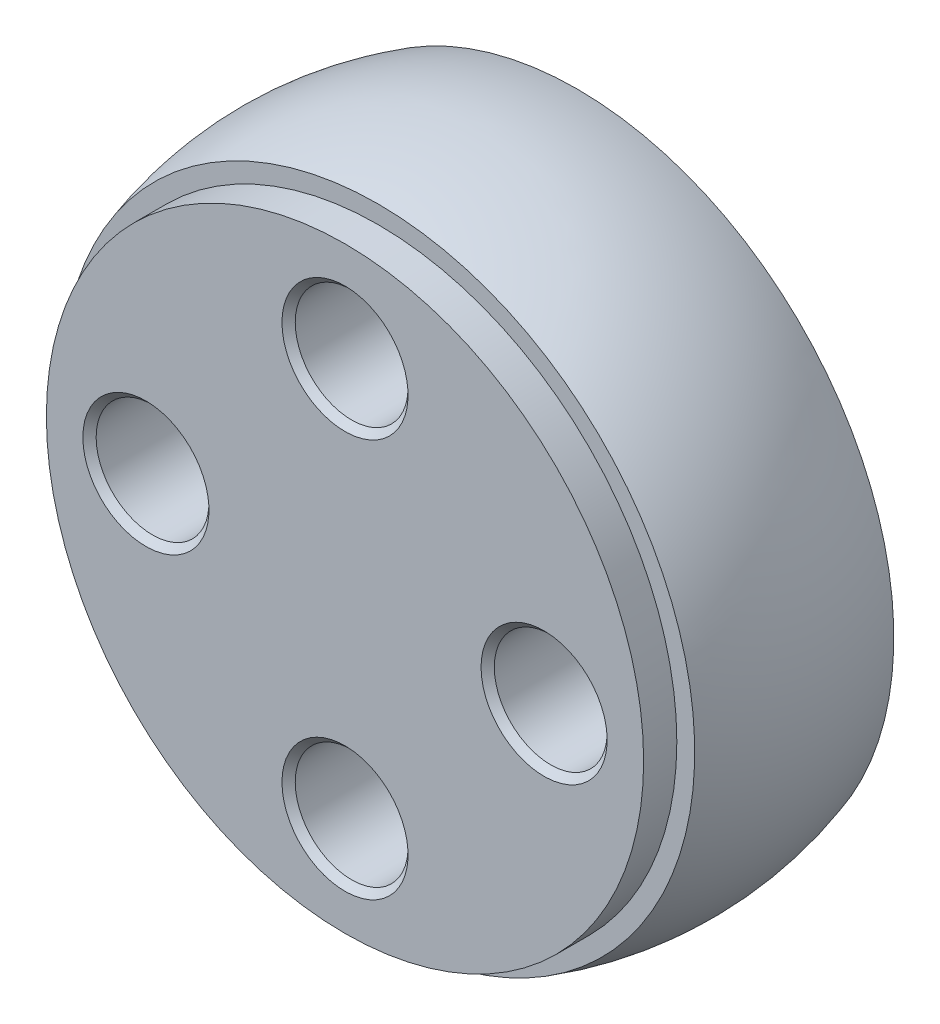
ISO-10303-21;
HEADER;
FILE_DESCRIPTION(('STEP AP214'),'2;1');
FILE_NAME('part.step','',(''),(''),'','','');
FILE_SCHEMA(('AUTOMOTIVE_DESIGN { 1 0 10303 214 1 1 1 1 }'));
ENDSEC;
DATA;
#1=APPLICATION_CONTEXT('core data for automotive mechanical design processes');
#2=APPLICATION_PROTOCOL_DEFINITION('international standard','automotive_design',2000,#1);
#3=PRODUCT_CONTEXT('',#1,'mechanical');
#4=PRODUCT('Part','Part','',(#3));
#5=PRODUCT_RELATED_PRODUCT_CATEGORY('part','',(#4));
#6=PRODUCT_DEFINITION_FORMATION('','',#4);
#7=PRODUCT_DEFINITION_CONTEXT('part definition',#1,'design');
#8=PRODUCT_DEFINITION('design','',#6,#7);
#9=PRODUCT_DEFINITION_SHAPE('','',#8);
#10=(LENGTH_UNIT() NAMED_UNIT(*) SI_UNIT(.MILLI.,.METRE.));
#11=(NAMED_UNIT(*) PLANE_ANGLE_UNIT() SI_UNIT($,.RADIAN.));
#12=(NAMED_UNIT(*) SI_UNIT($,.STERADIAN.) SOLID_ANGLE_UNIT());
#13=UNCERTAINTY_MEASURE_WITH_UNIT(LENGTH_MEASURE(1.E-05),#10,'distance_accuracy_value','');
#14=(GEOMETRIC_REPRESENTATION_CONTEXT(3) GLOBAL_UNCERTAINTY_ASSIGNED_CONTEXT((#13)) GLOBAL_UNIT_ASSIGNED_CONTEXT((#10,
#11,#12)) REPRESENTATION_CONTEXT('',''));
#15=CARTESIAN_POINT('',(0.,0.,0.));
#16=DIRECTION('',(0.,0.,1.));
#17=DIRECTION('',(1.,0.,0.));
#18=AXIS2_PLACEMENT_3D('',#15,#16,#17);
#19=CARTESIAN_POINT('',(0.,0.,0.));
#20=DIRECTION('',(0.,0.,-1.));
#21=DIRECTION('',(0.,1.,0.));
#22=AXIS2_PLACEMENT_3D('',#19,#20,#21);
#23=SPHERICAL_SURFACE('',#22,10.);
#24=CARTESIAN_POINT('',(0.,0.,3.));
#25=DIRECTION('',(0.,0.,-1.));
#26=DIRECTION('',(0.,1.,0.));
#27=AXIS2_PLACEMENT_3D('',#24,#25,#26);
#28=CIRCLE('',#27,9.53939201416946);
#29=CARTESIAN_POINT('',(0.,9.53939201416946,3.));
#30=VERTEX_POINT('',#29);
#31=EDGE_CURVE('E45',#30,#30,#28,.T.);
#32=ORIENTED_EDGE('',*,*,#31,.T.);
#33=EDGE_LOOP('',(#32));
#34=FACE_BOUND('',#33,.T.);
#35=CARTESIAN_POINT('',(0.,0.,-3.));
#36=DIRECTION('',(0.,0.,-1.));
#37=DIRECTION('',(0.,1.,0.));
#38=AXIS2_PLACEMENT_3D('',#35,#36,#37);
#39=CIRCLE('',#38,9.53939201416945);
#40=CARTESIAN_POINT('',(0.,9.53939201416945,-3.));
#41=VERTEX_POINT('',#40);
#42=EDGE_CURVE('E10',#41,#41,#39,.T.);
#43=ORIENTED_EDGE('',*,*,#42,.F.);
#44=EDGE_LOOP('',(#43));
#45=FACE_BOUND('',#44,.T.);
#46=ADVANCED_FACE('F31',(#34,#45),#23,.T.);
#47=CARTESIAN_POINT('',(0.,0.,-3.));
#48=DIRECTION('',(0.,0.,-1.));
#49=DIRECTION('',(0.,1.,0.));
#50=AXIS2_PLACEMENT_3D('',#47,#48,#49);
#51=PLANE('',#50);
#52=CARTESIAN_POINT('',(6.,0.,-3.));
#53=DIRECTION('',(0.,0.,-1.));
#54=DIRECTION('',(-1.,0.,0.));
#55=AXIS2_PLACEMENT_3D('',#52,#53,#54);
#56=CIRCLE('',#55,3.25);
#57=CARTESIAN_POINT('',(2.75,0.,-3.));
#58=VERTEX_POINT('',#57);
#59=EDGE_CURVE('E128',#58,#58,#56,.T.);
#60=ORIENTED_EDGE('',*,*,#59,.F.);
#61=EDGE_LOOP('',(#60));
#62=FACE_BOUND('',#61,.T.);
#63=CARTESIAN_POINT('',(-6.,0.,-3.));
#64=DIRECTION('',(0.,0.,-1.));
#65=DIRECTION('',(-1.,0.,0.));
#66=AXIS2_PLACEMENT_3D('',#63,#64,#65);
#67=CIRCLE('',#66,3.25);
#68=CARTESIAN_POINT('',(-9.25,0.,-3.));
#69=VERTEX_POINT('',#68);
#70=EDGE_CURVE('E107',#69,#69,#67,.T.);
#71=ORIENTED_EDGE('',*,*,#70,.F.);
#72=EDGE_LOOP('',(#71));
#73=FACE_BOUND('',#72,.T.);
#74=CARTESIAN_POINT('',(0.,6.,-3.));
#75=DIRECTION('',(0.,0.,-1.));
#76=DIRECTION('',(-1.,0.,0.));
#77=AXIS2_PLACEMENT_3D('',#74,#75,#76);
#78=CIRCLE('',#77,3.25);
#79=CARTESIAN_POINT('',(-3.25,6.,-3.));
#80=VERTEX_POINT('',#79);
#81=EDGE_CURVE('E86',#80,#80,#78,.T.);
#82=ORIENTED_EDGE('',*,*,#81,.F.);
#83=EDGE_LOOP('',(#82));
#84=FACE_BOUND('',#83,.T.);
#85=CARTESIAN_POINT('',(0.,-6.,-3.));
#86=DIRECTION('',(0.,0.,-1.));
#87=DIRECTION('',(-1.,0.,0.));
#88=AXIS2_PLACEMENT_3D('',#85,#86,#87);
#89=CIRCLE('',#88,3.25);
#90=CARTESIAN_POINT('',(-3.25,-6.,-3.));
#91=VERTEX_POINT('',#90);
#92=EDGE_CURVE('E65',#91,#91,#89,.T.);
#93=ORIENTED_EDGE('',*,*,#92,.F.);
#94=EDGE_LOOP('',(#93));
#95=FACE_BOUND('',#94,.T.);
#96=ORIENTED_EDGE('',*,*,#42,.T.);
#97=EDGE_LOOP('',(#96));
#98=FACE_BOUND('',#97,.T.);
#99=ADVANCED_FACE('F175',(#62,#73,#84,#95,#98),#51,.T.);
#100=CARTESIAN_POINT('',(0.,9.,4.));
#101=DIRECTION('',(0.,0.,1.));
#102=DIRECTION('',(0.,-1.,0.));
#103=AXIS2_PLACEMENT_3D('',#100,#101,#102);
#104=PLANE('',#103);
#105=CARTESIAN_POINT('',(6.,0.,4.));
#106=DIRECTION('',(0.,0.,-1.));
#107=DIRECTION('',(-1.,0.,0.));
#108=AXIS2_PLACEMENT_3D('',#105,#106,#107);
#109=CIRCLE('',#108,1.9);
#110=CARTESIAN_POINT('',(4.1,0.,4.));
#111=VERTEX_POINT('',#110);
#112=EDGE_CURVE('E131',#111,#111,#109,.T.);
#113=ORIENTED_EDGE('',*,*,#112,.T.);
#114=EDGE_LOOP('',(#113));
#115=FACE_BOUND('',#114,.T.);
#116=CARTESIAN_POINT('',(-6.,0.,4.));
#117=DIRECTION('',(0.,0.,-1.));
#118=DIRECTION('',(-1.,0.,0.));
#119=AXIS2_PLACEMENT_3D('',#116,#117,#118);
#120=CIRCLE('',#119,1.9);
#121=CARTESIAN_POINT('',(-7.9,0.,4.));
#122=VERTEX_POINT('',#121);
#123=EDGE_CURVE('E110',#122,#122,#120,.T.);
#124=ORIENTED_EDGE('',*,*,#123,.T.);
#125=EDGE_LOOP('',(#124));
#126=FACE_BOUND('',#125,.T.);
#127=CARTESIAN_POINT('',(0.,6.,4.));
#128=DIRECTION('',(0.,0.,-1.));
#129=DIRECTION('',(-1.,0.,0.));
#130=AXIS2_PLACEMENT_3D('',#127,#128,#129);
#131=CIRCLE('',#130,1.9);
#132=CARTESIAN_POINT('',(-1.9,6.,4.));
#133=VERTEX_POINT('',#132);
#134=EDGE_CURVE('E89',#133,#133,#131,.T.);
#135=ORIENTED_EDGE('',*,*,#134,.T.);
#136=EDGE_LOOP('',(#135));
#137=FACE_BOUND('',#136,.T.);
#138=CARTESIAN_POINT('',(0.,-6.,4.));
#139=DIRECTION('',(0.,0.,-1.));
#140=DIRECTION('',(-1.,0.,0.));
#141=AXIS2_PLACEMENT_3D('',#138,#139,#140);
#142=CIRCLE('',#141,1.9);
#143=CARTESIAN_POINT('',(-1.9,-6.,4.));
#144=VERTEX_POINT('',#143);
#145=EDGE_CURVE('E68',#144,#144,#142,.T.);
#146=ORIENTED_EDGE('',*,*,#145,.T.);
#147=EDGE_LOOP('',(#146));
#148=FACE_BOUND('',#147,.T.);
#149=CARTESIAN_POINT('',(0.,0.,4.));
#150=DIRECTION('',(0.,0.,-1.));
#151=DIRECTION('',(0.,1.,0.));
#152=AXIS2_PLACEMENT_3D('',#149,#150,#151);
#153=CIRCLE('',#152,9.);
#154=CARTESIAN_POINT('',(0.,9.,4.));
#155=VERTEX_POINT('',#154);
#156=EDGE_CURVE('E37',#155,#155,#153,.T.);
#157=ORIENTED_EDGE('',*,*,#156,.F.);
#158=EDGE_LOOP('',(#157));
#159=FACE_BOUND('',#158,.T.);
#160=ADVANCED_FACE('F135',(#115,#126,#137,#148,#159),#104,.T.);
#161=CARTESIAN_POINT('',(0.,0.,0.));
#162=DIRECTION('',(0.,0.,-1.));
#163=DIRECTION('',(0.,1.,0.));
#164=AXIS2_PLACEMENT_3D('',#161,#162,#163);
#165=CYLINDRICAL_SURFACE('',#164,9.);
#166=ORIENTED_EDGE('',*,*,#156,.T.);
#167=EDGE_LOOP('',(#166));
#168=FACE_BOUND('',#167,.T.);
#169=CARTESIAN_POINT('',(0.,0.,3.));
#170=DIRECTION('',(0.,0.,-1.));
#171=DIRECTION('',(0.,1.,0.));
#172=AXIS2_PLACEMENT_3D('',#169,#170,#171);
#173=CIRCLE('',#172,9.);
#174=CARTESIAN_POINT('',(0.,9.,3.));
#175=VERTEX_POINT('',#174);
#176=EDGE_CURVE('E41',#175,#175,#173,.T.);
#177=ORIENTED_EDGE('',*,*,#176,.F.);
#178=EDGE_LOOP('',(#177));
#179=FACE_BOUND('',#178,.T.);
#180=ADVANCED_FACE('F211',(#168,#179),#165,.T.);
#181=CARTESIAN_POINT('',(0.,9.,3.));
#182=DIRECTION('',(0.,0.,1.));
#183=DIRECTION('',(0.,-1.,0.));
#184=AXIS2_PLACEMENT_3D('',#181,#182,#183);
#185=PLANE('',#184);
#186=ORIENTED_EDGE('',*,*,#176,.T.);
#187=EDGE_LOOP('',(#186));
#188=FACE_BOUND('',#187,.T.);
#189=ORIENTED_EDGE('',*,*,#31,.F.);
#190=EDGE_LOOP('',(#189));
#191=FACE_BOUND('',#190,.T.);
#192=ADVANCED_FACE('F208',(#188,#191),#185,.T.);
#193=CARTESIAN_POINT('',(0.,-6.,3.8));
#194=DIRECTION('',(0.,0.,1.));
#195=DIRECTION('',(1.,0.,0.));
#196=AXIS2_PLACEMENT_3D('',#193,#194,#195);
#197=CONICAL_SURFACE('',#196,1.7,0.78539816339745);
#198=ORIENTED_EDGE('',*,*,#145,.F.);
#199=EDGE_LOOP('',(#198));
#200=FACE_BOUND('',#199,.T.);
#201=CARTESIAN_POINT('',(0.,-6.,3.8));
#202=DIRECTION('',(0.,0.,-1.));
#203=DIRECTION('',(-1.,0.,0.));
#204=AXIS2_PLACEMENT_3D('',#201,#202,#203);
#205=CIRCLE('',#204,1.7);
#206=CARTESIAN_POINT('',(-1.7,-6.,3.8));
#207=VERTEX_POINT('',#206);
#208=EDGE_CURVE('E50',#207,#207,#205,.T.);
#209=ORIENTED_EDGE('',*,*,#208,.T.);
#210=EDGE_LOOP('',(#209));
#211=FACE_BOUND('',#210,.T.);
#212=ADVANCED_FACE('F210',(#200,#211),#197,.F.);
#213=CARTESIAN_POINT('',(0.,-6.,-3.));
#214=DIRECTION('',(0.,0.,-1.));
#215=DIRECTION('',(-1.,0.,0.));
#216=AXIS2_PLACEMENT_3D('',#213,#214,#215);
#217=CYLINDRICAL_SURFACE('',#216,1.7);
#218=ORIENTED_EDGE('',*,*,#208,.F.);
#219=EDGE_LOOP('',(#218));
#220=FACE_BOUND('',#219,.T.);
#221=CARTESIAN_POINT('',(0.,-6.,0.599999999999995));
#222=DIRECTION('',(0.,0.,-1.));
#223=DIRECTION('',(-1.,0.,0.));
#224=AXIS2_PLACEMENT_3D('',#221,#222,#223);
#225=CIRCLE('',#224,1.7);
#226=CARTESIAN_POINT('',(-1.7,-6.,0.599999999999995));
#227=VERTEX_POINT('',#226);
#228=EDGE_CURVE('E53',#227,#227,#225,.T.);
#229=ORIENTED_EDGE('',*,*,#228,.T.);
#230=EDGE_LOOP('',(#229));
#231=FACE_BOUND('',#230,.T.);
#232=ADVANCED_FACE('F218',(#220,#231),#217,.F.);
#233=CARTESIAN_POINT('',(0.,-6.,0.399999999999996));
#234=DIRECTION('',(0.,0.,-1.));
#235=DIRECTION('',(-1.,0.,0.));
#236=AXIS2_PLACEMENT_3D('',#233,#234,#235);
#237=CONICAL_SURFACE('',#236,1.9,0.785398163397452);
#238=ORIENTED_EDGE('',*,*,#228,.F.);
#239=EDGE_LOOP('',(#238));
#240=FACE_BOUND('',#239,.T.);
#241=CARTESIAN_POINT('',(0.,-6.,0.399999999999996));
#242=DIRECTION('',(0.,0.,-1.));
#243=DIRECTION('',(-1.,0.,0.));
#244=AXIS2_PLACEMENT_3D('',#241,#242,#243);
#245=CIRCLE('',#244,1.9);
#246=CARTESIAN_POINT('',(-1.9,-6.,0.399999999999996));
#247=VERTEX_POINT('',#246);
#248=EDGE_CURVE('E56',#247,#247,#245,.T.);
#249=ORIENTED_EDGE('',*,*,#248,.T.);
#250=EDGE_LOOP('',(#249));
#251=FACE_BOUND('',#250,.T.);
#252=ADVANCED_FACE('F262',(#240,#251),#237,.F.);
#253=CARTESIAN_POINT('',(1.9,-6.,0.399999999999996));
#254=DIRECTION('',(0.,0.,1.));
#255=DIRECTION('',(1.,0.,0.));
#256=AXIS2_PLACEMENT_3D('',#253,#254,#255);
#257=PLANE('',#256);
#258=ORIENTED_EDGE('',*,*,#248,.F.);
#259=EDGE_LOOP('',(#258));
#260=FACE_BOUND('',#259,.T.);
#261=CARTESIAN_POINT('',(0.,-6.,0.399999999999996));
#262=DIRECTION('',(0.,0.,-1.));
#263=DIRECTION('',(-1.,0.,0.));
#264=AXIS2_PLACEMENT_3D('',#261,#262,#263);
#265=CIRCLE('',#264,3.);
#266=CARTESIAN_POINT('',(-3.,-6.,0.399999999999996));
#267=VERTEX_POINT('',#266);
#268=EDGE_CURVE('E59',#267,#267,#265,.T.);
#269=ORIENTED_EDGE('',*,*,#268,.T.);
#270=EDGE_LOOP('',(#269));
#271=FACE_BOUND('',#270,.T.);
#272=ADVANCED_FACE('F197',(#260,#271),#257,.F.);
#273=CARTESIAN_POINT('',(0.,-6.,-3.));
#274=DIRECTION('',(0.,0.,-1.));
#275=DIRECTION('',(-1.,0.,0.));
#276=AXIS2_PLACEMENT_3D('',#273,#274,#275);
#277=CYLINDRICAL_SURFACE('',#276,3.);
#278=ORIENTED_EDGE('',*,*,#268,.F.);
#279=EDGE_LOOP('',(#278));
#280=FACE_BOUND('',#279,.T.);
#281=CARTESIAN_POINT('',(0.,-6.,-2.75));
#282=DIRECTION('',(0.,0.,-1.));
#283=DIRECTION('',(-1.,0.,0.));
#284=AXIS2_PLACEMENT_3D('',#281,#282,#283);
#285=CIRCLE('',#284,3.);
#286=CARTESIAN_POINT('',(-3.,-6.,-2.75));
#287=VERTEX_POINT('',#286);
#288=EDGE_CURVE('E62',#287,#287,#285,.T.);
#289=ORIENTED_EDGE('',*,*,#288,.T.);
#290=EDGE_LOOP('',(#289));
#291=FACE_BOUND('',#290,.T.);
#292=ADVANCED_FACE('F187',(#280,#291),#277,.F.);
#293=CARTESIAN_POINT('',(0.,-6.,-3.));
#294=DIRECTION('',(0.,0.,-1.));
#295=DIRECTION('',(-1.,0.,0.));
#296=AXIS2_PLACEMENT_3D('',#293,#294,#295);
#297=CONICAL_SURFACE('',#296,3.25,0.785398163397448);
#298=ORIENTED_EDGE('',*,*,#288,.F.);
#299=EDGE_LOOP('',(#298));
#300=FACE_BOUND('',#299,.T.);
#301=ORIENTED_EDGE('',*,*,#92,.T.);
#302=EDGE_LOOP('',(#301));
#303=FACE_BOUND('',#302,.T.);
#304=ADVANCED_FACE('F184',(#300,#303),#297,.F.);
#305=CARTESIAN_POINT('',(0.,6.,3.8));
#306=DIRECTION('',(0.,0.,1.));
#307=DIRECTION('',(1.,0.,0.));
#308=AXIS2_PLACEMENT_3D('',#305,#306,#307);
#309=CONICAL_SURFACE('',#308,1.7,0.78539816339745);
#310=ORIENTED_EDGE('',*,*,#134,.F.);
#311=EDGE_LOOP('',(#310));
#312=FACE_BOUND('',#311,.T.);
#313=CARTESIAN_POINT('',(0.,6.,3.8));
#314=DIRECTION('',(0.,0.,-1.));
#315=DIRECTION('',(-1.,0.,0.));
#316=AXIS2_PLACEMENT_3D('',#313,#314,#315);
#317=CIRCLE('',#316,1.7);
#318=CARTESIAN_POINT('',(-1.7,6.,3.8));
#319=VERTEX_POINT('',#318);
#320=EDGE_CURVE('E71',#319,#319,#317,.T.);
#321=ORIENTED_EDGE('',*,*,#320,.T.);
#322=EDGE_LOOP('',(#321));
#323=FACE_BOUND('',#322,.T.);
#324=ADVANCED_FACE('F186',(#312,#323),#309,.F.);
#325=CARTESIAN_POINT('',(0.,6.,-3.));
#326=DIRECTION('',(0.,0.,-1.));
#327=DIRECTION('',(-1.,0.,0.));
#328=AXIS2_PLACEMENT_3D('',#325,#326,#327);
#329=CYLINDRICAL_SURFACE('',#328,1.7);
#330=ORIENTED_EDGE('',*,*,#320,.F.);
#331=EDGE_LOOP('',(#330));
#332=FACE_BOUND('',#331,.T.);
#333=CARTESIAN_POINT('',(0.,6.,0.599999999999995));
#334=DIRECTION('',(0.,0.,-1.));
#335=DIRECTION('',(-1.,0.,0.));
#336=AXIS2_PLACEMENT_3D('',#333,#334,#335);
#337=CIRCLE('',#336,1.7);
#338=CARTESIAN_POINT('',(-1.7,6.,0.599999999999995));
#339=VERTEX_POINT('',#338);
#340=EDGE_CURVE('E74',#339,#339,#337,.T.);
#341=ORIENTED_EDGE('',*,*,#340,.T.);
#342=EDGE_LOOP('',(#341));
#343=FACE_BOUND('',#342,.T.);
#344=ADVANCED_FACE('F194',(#332,#343),#329,.F.);
#345=CARTESIAN_POINT('',(0.,6.,0.399999999999996));
#346=DIRECTION('',(0.,0.,-1.));
#347=DIRECTION('',(-1.,0.,0.));
#348=AXIS2_PLACEMENT_3D('',#345,#346,#347);
#349=CONICAL_SURFACE('',#348,1.9,0.785398163397452);
#350=ORIENTED_EDGE('',*,*,#340,.F.);
#351=EDGE_LOOP('',(#350));
#352=FACE_BOUND('',#351,.T.);
#353=CARTESIAN_POINT('',(0.,6.,0.399999999999996));
#354=DIRECTION('',(0.,0.,-1.));
#355=DIRECTION('',(-1.,0.,0.));
#356=AXIS2_PLACEMENT_3D('',#353,#354,#355);
#357=CIRCLE('',#356,1.9);
#358=CARTESIAN_POINT('',(-1.9,6.,0.399999999999996));
#359=VERTEX_POINT('',#358);
#360=EDGE_CURVE('E77',#359,#359,#357,.T.);
#361=ORIENTED_EDGE('',*,*,#360,.T.);
#362=EDGE_LOOP('',(#361));
#363=FACE_BOUND('',#362,.T.);
#364=ADVANCED_FACE('F300',(#352,#363),#349,.F.);
#365=CARTESIAN_POINT('',(1.9,6.,0.399999999999996));
#366=DIRECTION('',(0.,0.,1.));
#367=DIRECTION('',(1.,0.,0.));
#368=AXIS2_PLACEMENT_3D('',#365,#366,#367);
#369=PLANE('',#368);
#370=ORIENTED_EDGE('',*,*,#360,.F.);
#371=EDGE_LOOP('',(#370));
#372=FACE_BOUND('',#371,.T.);
#373=CARTESIAN_POINT('',(0.,6.,0.399999999999996));
#374=DIRECTION('',(0.,0.,-1.));
#375=DIRECTION('',(-1.,0.,0.));
#376=AXIS2_PLACEMENT_3D('',#373,#374,#375);
#377=CIRCLE('',#376,3.);
#378=CARTESIAN_POINT('',(-3.,6.,0.399999999999996));
#379=VERTEX_POINT('',#378);
#380=EDGE_CURVE('E80',#379,#379,#377,.T.);
#381=ORIENTED_EDGE('',*,*,#380,.T.);
#382=EDGE_LOOP('',(#381));
#383=FACE_BOUND('',#382,.T.);
#384=ADVANCED_FACE('F309',(#372,#383),#369,.F.);
#385=CARTESIAN_POINT('',(0.,6.,-3.));
#386=DIRECTION('',(0.,0.,-1.));
#387=DIRECTION('',(-1.,0.,0.));
#388=AXIS2_PLACEMENT_3D('',#385,#386,#387);
#389=CYLINDRICAL_SURFACE('',#388,3.);
#390=ORIENTED_EDGE('',*,*,#380,.F.);
#391=EDGE_LOOP('',(#390));
#392=FACE_BOUND('',#391,.T.);
#393=CARTESIAN_POINT('',(0.,6.,-2.75));
#394=DIRECTION('',(0.,0.,-1.));
#395=DIRECTION('',(-1.,0.,0.));
#396=AXIS2_PLACEMENT_3D('',#393,#394,#395);
#397=CIRCLE('',#396,3.);
#398=CARTESIAN_POINT('',(-3.,6.,-2.75));
#399=VERTEX_POINT('',#398);
#400=EDGE_CURVE('E83',#399,#399,#397,.T.);
#401=ORIENTED_EDGE('',*,*,#400,.T.);
#402=EDGE_LOOP('',(#401));
#403=FACE_BOUND('',#402,.T.);
#404=ADVANCED_FACE('F318',(#392,#403),#389,.F.);
#405=CARTESIAN_POINT('',(0.,6.,-3.));
#406=DIRECTION('',(0.,0.,-1.));
#407=DIRECTION('',(-1.,0.,0.));
#408=AXIS2_PLACEMENT_3D('',#405,#406,#407);
#409=CONICAL_SURFACE('',#408,3.25,0.785398163397448);
#410=ORIENTED_EDGE('',*,*,#400,.F.);
#411=EDGE_LOOP('',(#410));
#412=FACE_BOUND('',#411,.T.);
#413=ORIENTED_EDGE('',*,*,#81,.T.);
#414=EDGE_LOOP('',(#413));
#415=FACE_BOUND('',#414,.T.);
#416=ADVANCED_FACE('F327',(#412,#415),#409,.F.);
#417=CARTESIAN_POINT('',(-6.,0.,3.8));
#418=DIRECTION('',(0.,0.,1.));
#419=DIRECTION('',(1.,0.,0.));
#420=AXIS2_PLACEMENT_3D('',#417,#418,#419);
#421=CONICAL_SURFACE('',#420,1.7,0.785398163397449);
#422=ORIENTED_EDGE('',*,*,#123,.F.);
#423=EDGE_LOOP('',(#422));
#424=FACE_BOUND('',#423,.T.);
#425=CARTESIAN_POINT('',(-6.,0.,3.8));
#426=DIRECTION('',(0.,0.,-1.));
#427=DIRECTION('',(-1.,0.,0.));
#428=AXIS2_PLACEMENT_3D('',#425,#426,#427);
#429=CIRCLE('',#428,1.7);
#430=CARTESIAN_POINT('',(-7.7,0.,3.8));
#431=VERTEX_POINT('',#430);
#432=EDGE_CURVE('E92',#431,#431,#429,.T.);
#433=ORIENTED_EDGE('',*,*,#432,.T.);
#434=EDGE_LOOP('',(#433));
#435=FACE_BOUND('',#434,.T.);
#436=ADVANCED_FACE('F336',(#424,#435),#421,.F.);
#437=CARTESIAN_POINT('',(-6.,0.,-3.));
#438=DIRECTION('',(0.,0.,-1.));
#439=DIRECTION('',(-1.,0.,0.));
#440=AXIS2_PLACEMENT_3D('',#437,#438,#439);
#441=CYLINDRICAL_SURFACE('',#440,1.7);
#442=ORIENTED_EDGE('',*,*,#432,.F.);
#443=EDGE_LOOP('',(#442));
#444=FACE_BOUND('',#443,.T.);
#445=CARTESIAN_POINT('',(-6.,0.,0.599999999999995));
#446=DIRECTION('',(0.,0.,-1.));
#447=DIRECTION('',(-1.,0.,0.));
#448=AXIS2_PLACEMENT_3D('',#445,#446,#447);
#449=CIRCLE('',#448,1.7);
#450=CARTESIAN_POINT('',(-7.7,0.,0.599999999999995));
#451=VERTEX_POINT('',#450);
#452=EDGE_CURVE('E95',#451,#451,#449,.T.);
#453=ORIENTED_EDGE('',*,*,#452,.T.);
#454=EDGE_LOOP('',(#453));
#455=FACE_BOUND('',#454,.T.);
#456=ADVANCED_FACE('F345',(#444,#455),#441,.F.);
#457=CARTESIAN_POINT('',(-6.,0.,0.399999999999996));
#458=DIRECTION('',(0.,0.,-1.));
#459=DIRECTION('',(-1.,0.,0.));
#460=AXIS2_PLACEMENT_3D('',#457,#458,#459);
#461=CONICAL_SURFACE('',#460,1.9,0.785398163397452);
#462=ORIENTED_EDGE('',*,*,#452,.F.);
#463=EDGE_LOOP('',(#462));
#464=FACE_BOUND('',#463,.T.);
#465=CARTESIAN_POINT('',(-6.,0.,0.399999999999996));
#466=DIRECTION('',(0.,0.,-1.));
#467=DIRECTION('',(-1.,0.,0.));
#468=AXIS2_PLACEMENT_3D('',#465,#466,#467);
#469=CIRCLE('',#468,1.9);
#470=CARTESIAN_POINT('',(-7.9,0.,0.399999999999996));
#471=VERTEX_POINT('',#470);
#472=EDGE_CURVE('E98',#471,#471,#469,.T.);
#473=ORIENTED_EDGE('',*,*,#472,.T.);
#474=EDGE_LOOP('',(#473));
#475=FACE_BOUND('',#474,.T.);
#476=ADVANCED_FACE('F354',(#464,#475),#461,.F.);
#477=CARTESIAN_POINT('',(-4.1,0.,0.399999999999996));
#478=DIRECTION('',(0.,0.,1.));
#479=DIRECTION('',(1.,0.,0.));
#480=AXIS2_PLACEMENT_3D('',#477,#478,#479);
#481=PLANE('',#480);
#482=ORIENTED_EDGE('',*,*,#472,.F.);
#483=EDGE_LOOP('',(#482));
#484=FACE_BOUND('',#483,.T.);
#485=CARTESIAN_POINT('',(-6.,0.,0.399999999999996));
#486=DIRECTION('',(0.,0.,-1.));
#487=DIRECTION('',(-1.,0.,0.));
#488=AXIS2_PLACEMENT_3D('',#485,#486,#487);
#489=CIRCLE('',#488,3.);
#490=CARTESIAN_POINT('',(-9.,0.,0.399999999999996));
#491=VERTEX_POINT('',#490);
#492=EDGE_CURVE('E101',#491,#491,#489,.T.);
#493=ORIENTED_EDGE('',*,*,#492,.T.);
#494=EDGE_LOOP('',(#493));
#495=FACE_BOUND('',#494,.T.);
#496=ADVANCED_FACE('F363',(#484,#495),#481,.F.);
#497=CARTESIAN_POINT('',(-6.,0.,-3.));
#498=DIRECTION('',(0.,0.,-1.));
#499=DIRECTION('',(-1.,0.,0.));
#500=AXIS2_PLACEMENT_3D('',#497,#498,#499);
#501=CYLINDRICAL_SURFACE('',#500,3.);
#502=ORIENTED_EDGE('',*,*,#492,.F.);
#503=EDGE_LOOP('',(#502));
#504=FACE_BOUND('',#503,.T.);
#505=CARTESIAN_POINT('',(-6.,0.,-2.75));
#506=DIRECTION('',(0.,0.,-1.));
#507=DIRECTION('',(-1.,0.,0.));
#508=AXIS2_PLACEMENT_3D('',#505,#506,#507);
#509=CIRCLE('',#508,3.);
#510=CARTESIAN_POINT('',(-9.,0.,-2.75));
#511=VERTEX_POINT('',#510);
#512=EDGE_CURVE('E104',#511,#511,#509,.T.);
#513=ORIENTED_EDGE('',*,*,#512,.T.);
#514=EDGE_LOOP('',(#513));
#515=FACE_BOUND('',#514,.T.);
#516=ADVANCED_FACE('F372',(#504,#515),#501,.F.);
#517=CARTESIAN_POINT('',(-6.,0.,-3.));
#518=DIRECTION('',(0.,0.,-1.));
#519=DIRECTION('',(-1.,0.,0.));
#520=AXIS2_PLACEMENT_3D('',#517,#518,#519);
#521=CONICAL_SURFACE('',#520,3.25,0.785398163397448);
#522=ORIENTED_EDGE('',*,*,#512,.F.);
#523=EDGE_LOOP('',(#522));
#524=FACE_BOUND('',#523,.T.);
#525=ORIENTED_EDGE('',*,*,#70,.T.);
#526=EDGE_LOOP('',(#525));
#527=FACE_BOUND('',#526,.T.);
#528=ADVANCED_FACE('F142',(#524,#527),#521,.F.);
#529=CARTESIAN_POINT('',(6.,0.,3.8));
#530=DIRECTION('',(0.,0.,1.));
#531=DIRECTION('',(1.,0.,0.));
#532=AXIS2_PLACEMENT_3D('',#529,#530,#531);
#533=CONICAL_SURFACE('',#532,1.7,0.785398163397452);
#534=ORIENTED_EDGE('',*,*,#112,.F.);
#535=EDGE_LOOP('',(#534));
#536=FACE_BOUND('',#535,.T.);
#537=CARTESIAN_POINT('',(6.,0.,3.8));
#538=DIRECTION('',(0.,0.,-1.));
#539=DIRECTION('',(-1.,0.,0.));
#540=AXIS2_PLACEMENT_3D('',#537,#538,#539);
#541=CIRCLE('',#540,1.7);
#542=CARTESIAN_POINT('',(4.3,0.,3.8));
#543=VERTEX_POINT('',#542);
#544=EDGE_CURVE('E113',#543,#543,#541,.T.);
#545=ORIENTED_EDGE('',*,*,#544,.T.);
#546=EDGE_LOOP('',(#545));
#547=FACE_BOUND('',#546,.T.);
#548=ADVANCED_FACE('F138',(#536,#547),#533,.F.);
#549=CARTESIAN_POINT('',(6.,0.,-3.));
#550=DIRECTION('',(0.,0.,-1.));
#551=DIRECTION('',(-1.,0.,0.));
#552=AXIS2_PLACEMENT_3D('',#549,#550,#551);
#553=CYLINDRICAL_SURFACE('',#552,1.7);
#554=ORIENTED_EDGE('',*,*,#544,.F.);
#555=EDGE_LOOP('',(#554));
#556=FACE_BOUND('',#555,.T.);
#557=CARTESIAN_POINT('',(6.,0.,0.599999999999995));
#558=DIRECTION('',(0.,0.,-1.));
#559=DIRECTION('',(-1.,0.,0.));
#560=AXIS2_PLACEMENT_3D('',#557,#558,#559);
#561=CIRCLE('',#560,1.7);
#562=CARTESIAN_POINT('',(4.3,0.,0.599999999999995));
#563=VERTEX_POINT('',#562);
#564=EDGE_CURVE('E116',#563,#563,#561,.T.);
#565=ORIENTED_EDGE('',*,*,#564,.T.);
#566=EDGE_LOOP('',(#565));
#567=FACE_BOUND('',#566,.T.);
#568=ADVANCED_FACE('F141',(#556,#567),#553,.F.);
#569=CARTESIAN_POINT('',(6.,0.,0.399999999999996));
#570=DIRECTION('',(0.,0.,-1.));
#571=DIRECTION('',(-1.,0.,0.));
#572=AXIS2_PLACEMENT_3D('',#569,#570,#571);
#573=CONICAL_SURFACE('',#572,1.9,0.785398163397452);
#574=ORIENTED_EDGE('',*,*,#564,.F.);
#575=EDGE_LOOP('',(#574));
#576=FACE_BOUND('',#575,.T.);
#577=CARTESIAN_POINT('',(6.,0.,0.399999999999996));
#578=DIRECTION('',(0.,0.,-1.));
#579=DIRECTION('',(-1.,0.,0.));
#580=AXIS2_PLACEMENT_3D('',#577,#578,#579);
#581=CIRCLE('',#580,1.9);
#582=CARTESIAN_POINT('',(4.1,0.,0.399999999999996));
#583=VERTEX_POINT('',#582);
#584=EDGE_CURVE('E119',#583,#583,#581,.T.);
#585=ORIENTED_EDGE('',*,*,#584,.T.);
#586=EDGE_LOOP('',(#585));
#587=FACE_BOUND('',#586,.T.);
#588=ADVANCED_FACE('F148',(#576,#587),#573,.F.);
#589=CARTESIAN_POINT('',(7.9,0.,0.399999999999996));
#590=DIRECTION('',(0.,0.,1.));
#591=DIRECTION('',(1.,0.,0.));
#592=AXIS2_PLACEMENT_3D('',#589,#590,#591);
#593=PLANE('',#592);
#594=ORIENTED_EDGE('',*,*,#584,.F.);
#595=EDGE_LOOP('',(#594));
#596=FACE_BOUND('',#595,.T.);
#597=CARTESIAN_POINT('',(6.,0.,0.399999999999996));
#598=DIRECTION('',(0.,0.,-1.));
#599=DIRECTION('',(-1.,0.,0.));
#600=AXIS2_PLACEMENT_3D('',#597,#598,#599);
#601=CIRCLE('',#600,3.);
#602=CARTESIAN_POINT('',(3.,0.,0.399999999999996));
#603=VERTEX_POINT('',#602);
#604=EDGE_CURVE('E122',#603,#603,#601,.T.);
#605=ORIENTED_EDGE('',*,*,#604,.T.);
#606=EDGE_LOOP('',(#605));
#607=FACE_BOUND('',#606,.T.);
#608=ADVANCED_FACE('F154',(#596,#607),#593,.F.);
#609=CARTESIAN_POINT('',(6.,0.,-3.));
#610=DIRECTION('',(0.,0.,-1.));
#611=DIRECTION('',(-1.,0.,0.));
#612=AXIS2_PLACEMENT_3D('',#609,#610,#611);
#613=CYLINDRICAL_SURFACE('',#612,3.);
#614=ORIENTED_EDGE('',*,*,#604,.F.);
#615=EDGE_LOOP('',(#614));
#616=FACE_BOUND('',#615,.T.);
#617=CARTESIAN_POINT('',(6.,0.,-2.75));
#618=DIRECTION('',(0.,0.,-1.));
#619=DIRECTION('',(-1.,0.,0.));
#620=AXIS2_PLACEMENT_3D('',#617,#618,#619);
#621=CIRCLE('',#620,3.);
#622=CARTESIAN_POINT('',(3.,0.,-2.75));
#623=VERTEX_POINT('',#622);
#624=EDGE_CURVE('E125',#623,#623,#621,.T.);
#625=ORIENTED_EDGE('',*,*,#624,.T.);
#626=EDGE_LOOP('',(#625));
#627=FACE_BOUND('',#626,.T.);
#628=ADVANCED_FACE('F160',(#616,#627),#613,.F.);
#629=CARTESIAN_POINT('',(6.,0.,-3.));
#630=DIRECTION('',(0.,0.,-1.));
#631=DIRECTION('',(-1.,0.,0.));
#632=AXIS2_PLACEMENT_3D('',#629,#630,#631);
#633=CONICAL_SURFACE('',#632,3.25,0.785398163397447);
#634=ORIENTED_EDGE('',*,*,#624,.F.);
#635=EDGE_LOOP('',(#634));
#636=FACE_BOUND('',#635,.T.);
#637=ORIENTED_EDGE('',*,*,#59,.T.);
#638=EDGE_LOOP('',(#637));
#639=FACE_BOUND('',#638,.T.);
#640=ADVANCED_FACE('F166',(#636,#639),#633,.F.);
#641=CLOSED_SHELL('',(#46,#99,#160,#180,#192,#212,#232,#252,#272,#292,#304,#324,#344,#364,#384,
#404,#416,#436,#456,#476,#496,#516,#528,#548,#568,#588,#608,#628,#640));
#642=MANIFOLD_SOLID_BREP('B2',#641);
#643=ADVANCED_BREP_SHAPE_REPRESENTATION('',(#18,#642),#14);
#644=SHAPE_DEFINITION_REPRESENTATION(#9,#643);
ENDSEC;
END-ISO-10303-21;
